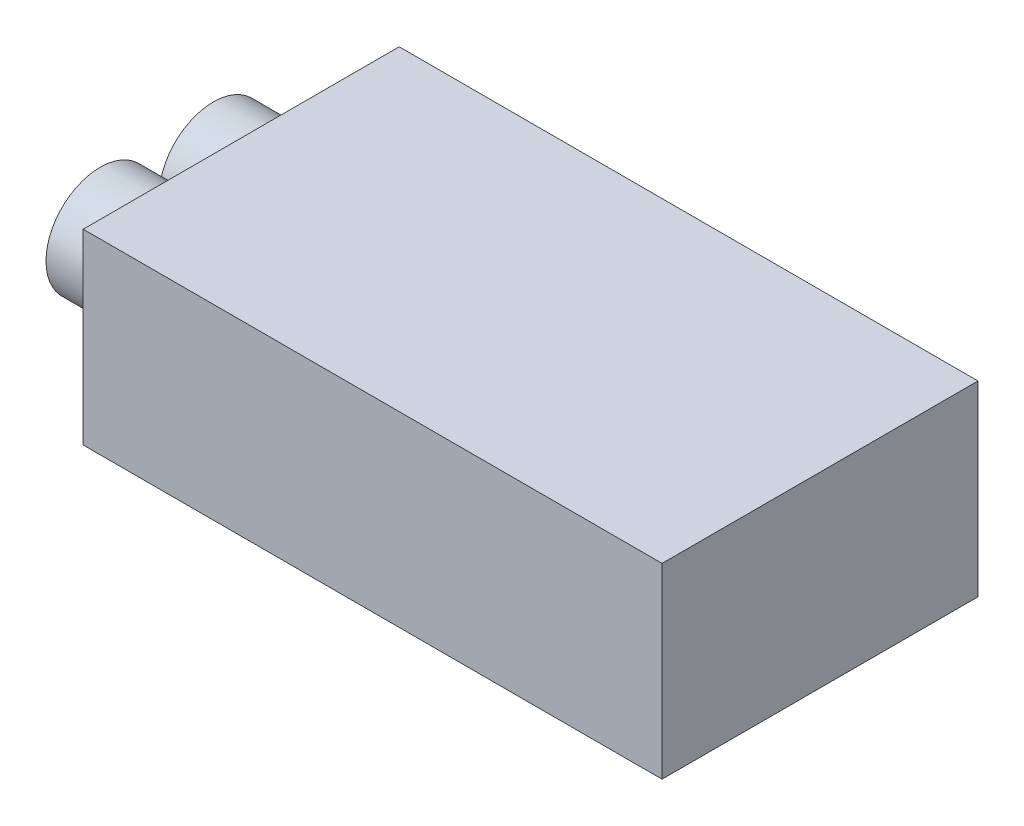
ISO-10303-21;
HEADER;
FILE_DESCRIPTION(('STEP AP214'),'2;1');
FILE_NAME('part.step','',(''),(''),'','','');
FILE_SCHEMA(('AUTOMOTIVE_DESIGN { 1 0 10303 214 1 1 1 1 }'));
ENDSEC;
DATA;
#1=APPLICATION_CONTEXT('core data for automotive mechanical design processes');
#2=APPLICATION_PROTOCOL_DEFINITION('international standard','automotive_design',2000,#1);
#3=PRODUCT_CONTEXT('',#1,'mechanical');
#4=PRODUCT('Part','Part','',(#3));
#5=PRODUCT_RELATED_PRODUCT_CATEGORY('part','',(#4));
#6=PRODUCT_DEFINITION_FORMATION('','',#4);
#7=PRODUCT_DEFINITION_CONTEXT('part definition',#1,'design');
#8=PRODUCT_DEFINITION('design','',#6,#7);
#9=PRODUCT_DEFINITION_SHAPE('','',#8);
#10=(LENGTH_UNIT() NAMED_UNIT(*) SI_UNIT(.MILLI.,.METRE.));
#11=(NAMED_UNIT(*) PLANE_ANGLE_UNIT() SI_UNIT($,.RADIAN.));
#12=(NAMED_UNIT(*) SI_UNIT($,.STERADIAN.) SOLID_ANGLE_UNIT());
#13=UNCERTAINTY_MEASURE_WITH_UNIT(LENGTH_MEASURE(1.E-05),#10,'distance_accuracy_value','');
#14=(GEOMETRIC_REPRESENTATION_CONTEXT(3) GLOBAL_UNCERTAINTY_ASSIGNED_CONTEXT((#13)) GLOBAL_UNIT_ASSIGNED_CONTEXT((#10,
#11,#12)) REPRESENTATION_CONTEXT('',''));
#15=CARTESIAN_POINT('',(0.,0.,0.));
#16=DIRECTION('',(0.,0.,1.));
#17=DIRECTION('',(1.,0.,0.));
#18=AXIS2_PLACEMENT_3D('',#15,#16,#17);
#19=CARTESIAN_POINT('',(-7.,7.75,-8.41117435949698));
#20=DIRECTION('',(1.,0.,0.));
#21=DIRECTION('',(0.,0.,-1.));
#22=AXIS2_PLACEMENT_3D('',#19,#20,#21);
#23=CYLINDRICAL_SURFACE('',#22,4.49795147807977);
#24=CARTESIAN_POINT('',(-7.,7.75,-8.41117435949698));
#25=DIRECTION('',(-1.,0.,0.));
#26=DIRECTION('',(0.,0.,1.));
#27=AXIS2_PLACEMENT_3D('',#24,#25,#26);
#28=CIRCLE('',#27,4.49795147807977);
#29=CARTESIAN_POINT('',(-7.,7.75,-3.91322288141721));
#30=VERTEX_POINT('',#29);
#31=EDGE_CURVE('E11',#30,#30,#28,.F.);
#32=ORIENTED_EDGE('',*,*,#31,.T.);
#33=EDGE_LOOP('',(#32));
#34=FACE_BOUND('',#33,.T.);
#35=CARTESIAN_POINT('',(0.,7.75,-8.41117435949698));
#36=DIRECTION('',(-1.,0.,0.));
#37=DIRECTION('',(0.,0.,1.));
#38=AXIS2_PLACEMENT_3D('',#35,#36,#37);
#39=CIRCLE('',#38,4.49795147807977);
#40=CARTESIAN_POINT('',(0.,7.75,-3.91322288141721));
#41=VERTEX_POINT('',#40);
#42=EDGE_CURVE('E45',#41,#41,#39,.F.);
#43=ORIENTED_EDGE('',*,*,#42,.F.);
#44=EDGE_LOOP('',(#43));
#45=FACE_BOUND('',#44,.T.);
#46=ADVANCED_FACE('F42',(#34,#45),#23,.T.);
#47=CARTESIAN_POINT('',(-7.,0.,0.));
#48=DIRECTION('',(-1.,0.,0.));
#49=DIRECTION('',(0.,0.,1.));
#50=AXIS2_PLACEMENT_3D('',#47,#48,#49);
#51=PLANE('',#50);
#52=ORIENTED_EDGE('',*,*,#31,.F.);
#53=EDGE_LOOP('',(#52));
#54=FACE_BOUND('',#53,.T.);
#55=ADVANCED_FACE('F57',(#54),#51,.T.);
#56=CARTESIAN_POINT('',(0.,0.,0.));
#57=DIRECTION('',(-1.,0.,0.));
#58=DIRECTION('',(0.,0.,1.));
#59=AXIS2_PLACEMENT_3D('',#56,#57,#58);
#60=PLANE('',#59);
#61=ORIENTED_EDGE('',*,*,#42,.T.);
#62=EDGE_LOOP('',(#61));
#63=FACE_BOUND('',#62,.T.);
#64=ADVANCED_FACE('F54',(#63),#60,.F.);
#65=CLOSED_SHELL('',(#46,#55,#64));
#66=MANIFOLD_SOLID_BREP('B2',#65);
#67=CARTESIAN_POINT('',(-7.,7.75,-17.7899757634926));
#68=DIRECTION('',(1.,0.,0.));
#69=DIRECTION('',(0.,0.,-1.));
#70=AXIS2_PLACEMENT_3D('',#67,#68,#69);
#71=CYLINDRICAL_SURFACE('',#70,4.49795147807977);
#72=CARTESIAN_POINT('',(-7.,7.75,-17.7899757634926));
#73=DIRECTION('',(-1.,0.,0.));
#74=DIRECTION('',(0.,0.,1.));
#75=AXIS2_PLACEMENT_3D('',#72,#73,#74);
#76=CIRCLE('',#75,4.49795147807977);
#77=CARTESIAN_POINT('',(-7.,7.75,-13.2920242854128));
#78=VERTEX_POINT('',#77);
#79=EDGE_CURVE('E41',#78,#78,#76,.T.);
#80=ORIENTED_EDGE('',*,*,#79,.F.);
#81=EDGE_LOOP('',(#80));
#82=FACE_BOUND('',#81,.T.);
#83=CARTESIAN_POINT('',(0.,7.75,-17.7899757634926));
#84=DIRECTION('',(-1.,0.,0.));
#85=DIRECTION('',(0.,0.,1.));
#86=AXIS2_PLACEMENT_3D('',#83,#84,#85);
#87=CIRCLE('',#86,4.49795147807977);
#88=CARTESIAN_POINT('',(0.,7.75,-13.2920242854128));
#89=VERTEX_POINT('',#88);
#90=EDGE_CURVE('E101',#89,#89,#87,.T.);
#91=ORIENTED_EDGE('',*,*,#90,.T.);
#92=EDGE_LOOP('',(#91));
#93=FACE_BOUND('',#92,.T.);
#94=ADVANCED_FACE('F98',(#82,#93),#71,.T.);
#95=CARTESIAN_POINT('',(-7.,0.,0.));
#96=DIRECTION('',(-1.,0.,0.));
#97=DIRECTION('',(0.,0.,1.));
#98=AXIS2_PLACEMENT_3D('',#95,#96,#97);
#99=PLANE('',#98);
#100=ORIENTED_EDGE('',*,*,#79,.T.);
#101=EDGE_LOOP('',(#100));
#102=FACE_BOUND('',#101,.T.);
#103=ADVANCED_FACE('F113',(#102),#99,.T.);
#104=CARTESIAN_POINT('',(0.,0.,0.));
#105=DIRECTION('',(-1.,0.,0.));
#106=DIRECTION('',(0.,0.,1.));
#107=AXIS2_PLACEMENT_3D('',#104,#105,#106);
#108=PLANE('',#107);
#109=ORIENTED_EDGE('',*,*,#90,.F.);
#110=EDGE_LOOP('',(#109));
#111=FACE_BOUND('',#110,.T.);
#112=ADVANCED_FACE('F111',(#111),#108,.F.);
#113=CLOSED_SHELL('',(#94,#103,#112));
#114=MANIFOLD_SOLID_BREP('B6',#113);
#115=CARTESIAN_POINT('',(0.,15.5,-26.2011501229896));
#116=DIRECTION('',(1.,0.,0.));
#117=DIRECTION('',(0.,0.,-1.));
#118=AXIS2_PLACEMENT_3D('',#115,#116,#117);
#119=PLANE('',#118);
#120=DIRECTION('',(0.,0.,1.));
#121=VECTOR('',#120,1.);
#122=CARTESIAN_POINT('',(0.,0.,-26.2011501229896));
#123=LINE('',#122,#121);
#124=CARTESIAN_POINT('',(0.,0.,-26.2011501229896));
#125=VERTEX_POINT('',#124);
#126=CARTESIAN_POINT('',(0.,0.,0.));
#127=VERTEX_POINT('',#126);
#128=EDGE_CURVE('E208',#125,#127,#123,.T.);
#129=ORIENTED_EDGE('',*,*,#128,.T.);
#130=DIRECTION('',(0.,-1.,0.));
#131=VECTOR('',#130,1.);
#132=CARTESIAN_POINT('',(0.,15.5,0.));
#133=LINE('',#132,#131);
#134=CARTESIAN_POINT('',(0.,15.5,0.));
#135=VERTEX_POINT('',#134);
#136=EDGE_CURVE('E96',#135,#127,#133,.T.);
#137=ORIENTED_EDGE('',*,*,#136,.F.);
#138=DIRECTION('',(0.,0.,1.));
#139=VECTOR('',#138,1.);
#140=CARTESIAN_POINT('',(0.,15.5,-26.2011501229896));
#141=LINE('',#140,#139);
#142=CARTESIAN_POINT('',(0.,15.5,-26.2011501229896));
#143=VERTEX_POINT('',#142);
#144=EDGE_CURVE('E196',#143,#135,#141,.T.);
#145=ORIENTED_EDGE('',*,*,#144,.F.);
#146=DIRECTION('',(0.,-1.,0.));
#147=VECTOR('',#146,1.);
#148=CARTESIAN_POINT('',(0.,15.5,-26.2011501229896));
#149=LINE('',#148,#147);
#150=EDGE_CURVE('E204',#143,#125,#149,.T.);
#151=ORIENTED_EDGE('',*,*,#150,.T.);
#152=EDGE_LOOP('',(#129,#137,#145,#151));
#153=FACE_BOUND('',#152,.T.);
#154=ADVANCED_FACE('F145',(#153),#119,.F.);
#155=CARTESIAN_POINT('',(0.,15.5,0.));
#156=DIRECTION('',(0.,0.,-1.));
#157=DIRECTION('',(-1.,0.,0.));
#158=AXIS2_PLACEMENT_3D('',#155,#156,#157);
#159=PLANE('',#158);
#160=DIRECTION('',(1.,0.,0.));
#161=VECTOR('',#160,1.);
#162=CARTESIAN_POINT('',(0.,0.,0.));
#163=LINE('',#162,#161);
#164=CARTESIAN_POINT('',(48.,0.,0.));
#165=VERTEX_POINT('',#164);
#166=EDGE_CURVE('E200',#127,#165,#163,.T.);
#167=ORIENTED_EDGE('',*,*,#166,.T.);
#168=DIRECTION('',(0.,-1.,0.));
#169=VECTOR('',#168,1.);
#170=CARTESIAN_POINT('',(48.,15.5,0.));
#171=LINE('',#170,#169);
#172=CARTESIAN_POINT('',(48.,15.5,0.));
#173=VERTEX_POINT('',#172);
#174=EDGE_CURVE('E153',#173,#165,#171,.T.);
#175=ORIENTED_EDGE('',*,*,#174,.F.);
#176=DIRECTION('',(1.,0.,0.));
#177=VECTOR('',#176,1.);
#178=CARTESIAN_POINT('',(0.,15.5,0.));
#179=LINE('',#178,#177);
#180=EDGE_CURVE('E191',#135,#173,#179,.T.);
#181=ORIENTED_EDGE('',*,*,#180,.F.);
#182=ORIENTED_EDGE('',*,*,#136,.T.);
#183=EDGE_LOOP('',(#167,#175,#181,#182));
#184=FACE_BOUND('',#183,.T.);
#185=ADVANCED_FACE('F199',(#184),#159,.F.);
#186=CARTESIAN_POINT('',(48.,15.5,0.));
#187=DIRECTION('',(-1.,0.,0.));
#188=DIRECTION('',(0.,0.,1.));
#189=AXIS2_PLACEMENT_3D('',#186,#187,#188);
#190=PLANE('',#189);
#191=DIRECTION('',(0.,0.,-1.));
#192=VECTOR('',#191,1.);
#193=CARTESIAN_POINT('',(48.,0.,0.));
#194=LINE('',#193,#192);
#195=CARTESIAN_POINT('',(48.,0.,-26.2011501229896));
#196=VERTEX_POINT('',#195);
#197=EDGE_CURVE('E178',#165,#196,#194,.T.);
#198=ORIENTED_EDGE('',*,*,#197,.T.);
#199=DIRECTION('',(0.,-1.,0.));
#200=VECTOR('',#199,1.);
#201=CARTESIAN_POINT('',(48.,15.5,-26.2011501229896));
#202=LINE('',#201,#200);
#203=CARTESIAN_POINT('',(48.,15.5,-26.2011501229896));
#204=VERTEX_POINT('',#203);
#205=EDGE_CURVE('E201',#204,#196,#202,.T.);
#206=ORIENTED_EDGE('',*,*,#205,.F.);
#207=DIRECTION('',(0.,0.,-1.));
#208=VECTOR('',#207,1.);
#209=CARTESIAN_POINT('',(48.,15.5,0.));
#210=LINE('',#209,#208);
#211=EDGE_CURVE('E194',#173,#204,#210,.T.);
#212=ORIENTED_EDGE('',*,*,#211,.F.);
#213=ORIENTED_EDGE('',*,*,#174,.T.);
#214=EDGE_LOOP('',(#198,#206,#212,#213));
#215=FACE_BOUND('',#214,.T.);
#216=ADVANCED_FACE('F202',(#215),#190,.F.);
#217=CARTESIAN_POINT('',(48.,15.5,-26.2011501229896));
#218=DIRECTION('',(0.,0.,1.));
#219=DIRECTION('',(1.,0.,0.));
#220=AXIS2_PLACEMENT_3D('',#217,#218,#219);
#221=PLANE('',#220);
#222=DIRECTION('',(-1.,0.,0.));
#223=VECTOR('',#222,1.);
#224=CARTESIAN_POINT('',(48.,0.,-26.2011501229896));
#225=LINE('',#224,#223);
#226=EDGE_CURVE('E184',#196,#125,#225,.T.);
#227=ORIENTED_EDGE('',*,*,#226,.T.);
#228=ORIENTED_EDGE('',*,*,#150,.F.);
#229=DIRECTION('',(-1.,0.,0.));
#230=VECTOR('',#229,1.);
#231=CARTESIAN_POINT('',(48.,15.5,-26.2011501229896));
#232=LINE('',#231,#230);
#233=EDGE_CURVE('E161',#204,#143,#232,.T.);
#234=ORIENTED_EDGE('',*,*,#233,.F.);
#235=ORIENTED_EDGE('',*,*,#205,.T.);
#236=EDGE_LOOP('',(#227,#228,#234,#235));
#237=FACE_BOUND('',#236,.T.);
#238=ADVANCED_FACE('F215',(#237),#221,.F.);
#239=CARTESIAN_POINT('',(0.,15.5,0.));
#240=DIRECTION('',(0.,1.,0.));
#241=DIRECTION('',(0.,0.,1.));
#242=AXIS2_PLACEMENT_3D('',#239,#240,#241);
#243=PLANE('',#242);
#244=ORIENTED_EDGE('',*,*,#144,.T.);
#245=ORIENTED_EDGE('',*,*,#180,.T.);
#246=ORIENTED_EDGE('',*,*,#211,.T.);
#247=ORIENTED_EDGE('',*,*,#233,.T.);
#248=EDGE_LOOP('',(#244,#245,#246,#247));
#249=FACE_BOUND('',#248,.T.);
#250=ADVANCED_FACE('F192',(#249),#243,.T.);
#251=CARTESIAN_POINT('',(0.,0.,0.));
#252=DIRECTION('',(0.,1.,0.));
#253=DIRECTION('',(0.,0.,1.));
#254=AXIS2_PLACEMENT_3D('',#251,#252,#253);
#255=PLANE('',#254);
#256=ORIENTED_EDGE('',*,*,#128,.F.);
#257=ORIENTED_EDGE('',*,*,#226,.F.);
#258=ORIENTED_EDGE('',*,*,#197,.F.);
#259=ORIENTED_EDGE('',*,*,#166,.F.);
#260=EDGE_LOOP('',(#256,#257,#258,#259));
#261=FACE_BOUND('',#260,.T.);
#262=ADVANCED_FACE('F218',(#261),#255,.F.);
#263=CLOSED_SHELL('',(#154,#185,#216,#238,#250,#262));
#264=MANIFOLD_SOLID_BREP('B36',#263);
#265=ADVANCED_BREP_SHAPE_REPRESENTATION('',(#18,#66,#114,#264),#14);
#266=SHAPE_DEFINITION_REPRESENTATION(#9,#265);
ENDSEC;
END-ISO-10303-21;
